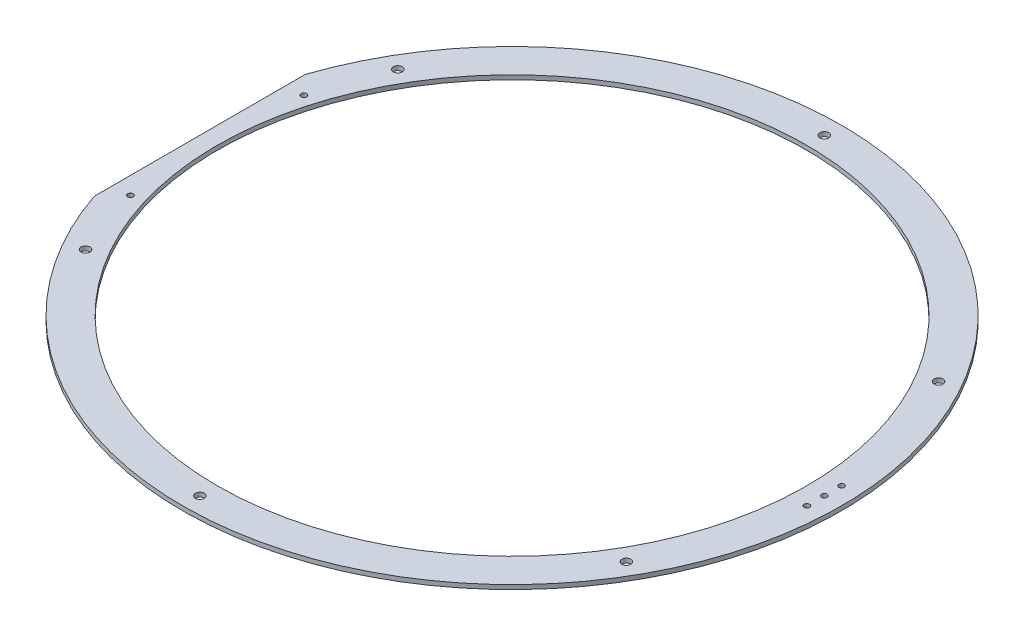
ISO-10303-21;
HEADER;
FILE_DESCRIPTION(('STEP AP214'),'2;1');
FILE_NAME('part.step','',(''),(''),'','','');
FILE_SCHEMA(('AUTOMOTIVE_DESIGN { 1 0 10303 214 1 1 1 1 }'));
ENDSEC;
DATA;
#1=APPLICATION_CONTEXT('core data for automotive mechanical design processes');
#2=APPLICATION_PROTOCOL_DEFINITION('international standard','automotive_design',2000,#1);
#3=PRODUCT_CONTEXT('',#1,'mechanical');
#4=PRODUCT('Part','Part','',(#3));
#5=PRODUCT_RELATED_PRODUCT_CATEGORY('part','',(#4));
#6=PRODUCT_DEFINITION_FORMATION('','',#4);
#7=PRODUCT_DEFINITION_CONTEXT('part definition',#1,'design');
#8=PRODUCT_DEFINITION('design','',#6,#7);
#9=PRODUCT_DEFINITION_SHAPE('','',#8);
#10=(LENGTH_UNIT() NAMED_UNIT(*) SI_UNIT(.MILLI.,.METRE.));
#11=(NAMED_UNIT(*) PLANE_ANGLE_UNIT() SI_UNIT($,.RADIAN.));
#12=(NAMED_UNIT(*) SI_UNIT($,.STERADIAN.) SOLID_ANGLE_UNIT());
#13=UNCERTAINTY_MEASURE_WITH_UNIT(LENGTH_MEASURE(1.E-05),#10,'distance_accuracy_value','');
#14=(GEOMETRIC_REPRESENTATION_CONTEXT(3) GLOBAL_UNCERTAINTY_ASSIGNED_CONTEXT((#13)) GLOBAL_UNIT_ASSIGNED_CONTEXT((#10,
#11,#12)) REPRESENTATION_CONTEXT('',''));
#15=CARTESIAN_POINT('',(0.,0.,0.));
#16=DIRECTION('',(0.,0.,1.));
#17=DIRECTION('',(1.,0.,0.));
#18=AXIS2_PLACEMENT_3D('',#15,#16,#17);
#19=CARTESIAN_POINT('',(-228.6,3.175,0.));
#20=DIRECTION('',(1.,0.,0.));
#21=DIRECTION('',(0.,0.,-1.));
#22=AXIS2_PLACEMENT_3D('',#19,#20,#21);
#23=PLANE('',#22);
#24=DIRECTION('',(0.,0.,1.));
#25=VECTOR('',#24,1.);
#26=CARTESIAN_POINT('',(-228.6,0.,0.));
#27=LINE('',#26,#25);
#28=CARTESIAN_POINT('',(-228.6,0.,-77.251084131));
#29=VERTEX_POINT('',#28);
#30=CARTESIAN_POINT('',(-228.6,0.,77.251084131));
#31=VERTEX_POINT('',#30);
#32=EDGE_CURVE('E71',#29,#31,#27,.T.);
#33=ORIENTED_EDGE('',*,*,#32,.T.);
#34=DIRECTION('',(0.,-1.,0.));
#35=VECTOR('',#34,1.);
#36=CARTESIAN_POINT('',(-228.6,3.175,77.251084131));
#37=LINE('',#36,#35);
#38=CARTESIAN_POINT('',(-228.6,3.175,77.251084131));
#39=VERTEX_POINT('',#38);
#40=EDGE_CURVE('E11',#39,#31,#37,.T.);
#41=ORIENTED_EDGE('',*,*,#40,.F.);
#42=DIRECTION('',(0.,0.,1.));
#43=VECTOR('',#42,1.);
#44=CARTESIAN_POINT('',(-228.6,3.175,0.));
#45=LINE('',#44,#43);
#46=CARTESIAN_POINT('',(-228.6,3.175,-77.251084131));
#47=VERTEX_POINT('',#46);
#48=EDGE_CURVE('E74',#47,#39,#45,.T.);
#49=ORIENTED_EDGE('',*,*,#48,.F.);
#50=DIRECTION('',(0.,-1.,0.));
#51=VECTOR('',#50,1.);
#52=CARTESIAN_POINT('',(-228.6,3.175,-77.251084131));
#53=LINE('',#52,#51);
#54=EDGE_CURVE('E48',#47,#29,#53,.T.);
#55=ORIENTED_EDGE('',*,*,#54,.T.);
#56=EDGE_LOOP('',(#33,#41,#49,#55));
#57=FACE_BOUND('',#56,.T.);
#58=ADVANCED_FACE('F39',(#57),#23,.F.);
#59=CARTESIAN_POINT('',(0.,3.175,0.));
#60=DIRECTION('',(0.,-1.,0.));
#61=DIRECTION('',(0.,0.,-1.));
#62=AXIS2_PLACEMENT_3D('',#59,#60,#61);
#63=CYLINDRICAL_SURFACE('',#62,215.9);
#64=CARTESIAN_POINT('',(0.,3.175,0.));
#65=DIRECTION('',(0.,1.,0.));
#66=DIRECTION('',(0.,0.,1.));
#67=AXIS2_PLACEMENT_3D('',#64,#65,#66);
#68=CIRCLE('',#67,215.9);
#69=CARTESIAN_POINT('',(0.,3.175,215.9));
#70=VERTEX_POINT('',#69);
#71=EDGE_CURVE('E116',#70,#70,#68,.T.);
#72=ORIENTED_EDGE('',*,*,#71,.T.);
#73=EDGE_LOOP('',(#72));
#74=FACE_BOUND('',#73,.T.);
#75=CARTESIAN_POINT('',(0.,0.,0.));
#76=DIRECTION('',(0.,1.,0.));
#77=DIRECTION('',(0.,0.,1.));
#78=AXIS2_PLACEMENT_3D('',#75,#76,#77);
#79=CIRCLE('',#78,215.9);
#80=CARTESIAN_POINT('',(0.,0.,215.9));
#81=VERTEX_POINT('',#80);
#82=EDGE_CURVE('E76',#81,#81,#79,.T.);
#83=ORIENTED_EDGE('',*,*,#82,.F.);
#84=EDGE_LOOP('',(#83));
#85=FACE_BOUND('',#84,.T.);
#86=ADVANCED_FACE('F180',(#74,#85),#63,.F.);
#87=CARTESIAN_POINT('',(0.,3.175,-228.6));
#88=DIRECTION('',(0.,-1.,0.));
#89=DIRECTION('',(0.,0.,-1.));
#90=AXIS2_PLACEMENT_3D('',#87,#88,#89);
#91=CYLINDRICAL_SURFACE('',#90,3.2639);
#92=CARTESIAN_POINT('',(0.,3.175,-228.6));
#93=DIRECTION('',(0.,1.,0.));
#94=DIRECTION('',(0.,0.,1.));
#95=AXIS2_PLACEMENT_3D('',#92,#93,#94);
#96=CIRCLE('',#95,3.2639);
#97=CARTESIAN_POINT('',(0.,3.175,-225.3361));
#98=VERTEX_POINT('',#97);
#99=EDGE_CURVE('E119',#98,#98,#96,.T.);
#100=ORIENTED_EDGE('',*,*,#99,.T.);
#101=EDGE_LOOP('',(#100));
#102=FACE_BOUND('',#101,.T.);
#103=CARTESIAN_POINT('',(0.,0.,-228.6));
#104=DIRECTION('',(0.,1.,0.));
#105=DIRECTION('',(0.,0.,1.));
#106=AXIS2_PLACEMENT_3D('',#103,#104,#105);
#107=CIRCLE('',#106,3.2639);
#108=CARTESIAN_POINT('',(0.,0.,-225.3361));
#109=VERTEX_POINT('',#108);
#110=EDGE_CURVE('E79',#109,#109,#107,.T.);
#111=ORIENTED_EDGE('',*,*,#110,.F.);
#112=EDGE_LOOP('',(#111));
#113=FACE_BOUND('',#112,.T.);
#114=ADVANCED_FACE('F183',(#102,#113),#91,.F.);
#115=CARTESIAN_POINT('',(197.973407305129,3.175,-114.300000000011));
#116=DIRECTION('',(0.,-1.,0.));
#117=DIRECTION('',(0.,0.,-1.));
#118=AXIS2_PLACEMENT_3D('',#115,#116,#117);
#119=CYLINDRICAL_SURFACE('',#118,3.26389999999998);
#120=CARTESIAN_POINT('',(197.973407305129,3.175,-114.300000000011));
#121=DIRECTION('',(0.,1.,0.));
#122=DIRECTION('',(0.,0.,1.));
#123=AXIS2_PLACEMENT_3D('',#120,#121,#122);
#124=CIRCLE('',#123,3.26389999999998);
#125=CARTESIAN_POINT('',(197.973407305129,3.175,-111.036100000011));
#126=VERTEX_POINT('',#125);
#127=EDGE_CURVE('E122',#126,#126,#124,.T.);
#128=ORIENTED_EDGE('',*,*,#127,.T.);
#129=EDGE_LOOP('',(#128));
#130=FACE_BOUND('',#129,.T.);
#131=CARTESIAN_POINT('',(197.973407305129,0.,-114.300000000011));
#132=DIRECTION('',(0.,1.,0.));
#133=DIRECTION('',(0.,0.,1.));
#134=AXIS2_PLACEMENT_3D('',#131,#132,#133);
#135=CIRCLE('',#134,3.26389999999998);
#136=CARTESIAN_POINT('',(197.973407305129,0.,-111.036100000011));
#137=VERTEX_POINT('',#136);
#138=EDGE_CURVE('E84',#137,#137,#135,.T.);
#139=ORIENTED_EDGE('',*,*,#138,.F.);
#140=EDGE_LOOP('',(#139));
#141=FACE_BOUND('',#140,.T.);
#142=ADVANCED_FACE('F201',(#130,#141),#119,.F.);
#143=CARTESIAN_POINT('',(197.973407305142,3.175,114.299999999989));
#144=DIRECTION('',(0.,-1.,0.));
#145=DIRECTION('',(0.,0.,-1.));
#146=AXIS2_PLACEMENT_3D('',#143,#144,#145);
#147=CYLINDRICAL_SURFACE('',#146,3.26389999999998);
#148=CARTESIAN_POINT('',(197.973407305142,3.175,114.299999999989));
#149=DIRECTION('',(0.,1.,0.));
#150=DIRECTION('',(0.,0.,1.));
#151=AXIS2_PLACEMENT_3D('',#148,#149,#150);
#152=CIRCLE('',#151,3.26389999999998);
#153=CARTESIAN_POINT('',(197.973407305142,3.175,117.563899999989));
#154=VERTEX_POINT('',#153);
#155=EDGE_CURVE('E125',#154,#154,#152,.T.);
#156=ORIENTED_EDGE('',*,*,#155,.T.);
#157=EDGE_LOOP('',(#156));
#158=FACE_BOUND('',#157,.T.);
#159=CARTESIAN_POINT('',(197.973407305142,0.,114.299999999989));
#160=DIRECTION('',(0.,1.,0.));
#161=DIRECTION('',(0.,0.,1.));
#162=AXIS2_PLACEMENT_3D('',#159,#160,#161);
#163=CIRCLE('',#162,3.26389999999998);
#164=CARTESIAN_POINT('',(197.973407305142,0.,117.563899999989));
#165=VERTEX_POINT('',#164);
#166=EDGE_CURVE('E87',#165,#165,#163,.T.);
#167=ORIENTED_EDGE('',*,*,#166,.F.);
#168=EDGE_LOOP('',(#167));
#169=FACE_BOUND('',#168,.T.);
#170=ADVANCED_FACE('F205',(#158,#169),#147,.F.);
#171=CARTESIAN_POINT('',(2.59048248256759E-11,3.175,228.6));
#172=DIRECTION('',(0.,-1.,0.));
#173=DIRECTION('',(0.,0.,-1.));
#174=AXIS2_PLACEMENT_3D('',#171,#172,#173);
#175=CYLINDRICAL_SURFACE('',#174,3.2639);
#176=CARTESIAN_POINT('',(2.59048248256759E-11,3.175,228.6));
#177=DIRECTION('',(0.,1.,0.));
#178=DIRECTION('',(0.,0.,1.));
#179=AXIS2_PLACEMENT_3D('',#176,#177,#178);
#180=CIRCLE('',#179,3.2639);
#181=CARTESIAN_POINT('',(2.59048248256759E-11,3.175,231.8639));
#182=VERTEX_POINT('',#181);
#183=EDGE_CURVE('E128',#182,#182,#180,.T.);
#184=ORIENTED_EDGE('',*,*,#183,.T.);
#185=EDGE_LOOP('',(#184));
#186=FACE_BOUND('',#185,.T.);
#187=CARTESIAN_POINT('',(2.59048248256759E-11,0.,228.6));
#188=DIRECTION('',(0.,1.,0.));
#189=DIRECTION('',(0.,0.,1.));
#190=AXIS2_PLACEMENT_3D('',#187,#188,#189);
#191=CIRCLE('',#190,3.2639);
#192=CARTESIAN_POINT('',(2.59048248256759E-11,0.,231.8639));
#193=VERTEX_POINT('',#192);
#194=EDGE_CURVE('E90',#193,#193,#191,.T.);
#195=ORIENTED_EDGE('',*,*,#194,.F.);
#196=EDGE_LOOP('',(#195));
#197=FACE_BOUND('',#196,.T.);
#198=ADVANCED_FACE('F209',(#186,#197),#175,.F.);
#199=CARTESIAN_POINT('',(-197.973407305103,3.175,114.300000000011));
#200=DIRECTION('',(0.,-1.,0.));
#201=DIRECTION('',(0.,0.,-1.));
#202=AXIS2_PLACEMENT_3D('',#199,#200,#201);
#203=CYLINDRICAL_SURFACE('',#202,3.26390000000001);
#204=CARTESIAN_POINT('',(-197.973407305103,3.175,114.300000000011));
#205=DIRECTION('',(0.,1.,0.));
#206=DIRECTION('',(0.,0.,1.));
#207=AXIS2_PLACEMENT_3D('',#204,#205,#206);
#208=CIRCLE('',#207,3.26390000000001);
#209=CARTESIAN_POINT('',(-197.973407305103,3.175,117.563900000011));
#210=VERTEX_POINT('',#209);
#211=EDGE_CURVE('E131',#210,#210,#208,.T.);
#212=ORIENTED_EDGE('',*,*,#211,.T.);
#213=EDGE_LOOP('',(#212));
#214=FACE_BOUND('',#213,.T.);
#215=CARTESIAN_POINT('',(-197.973407305103,0.,114.300000000011));
#216=DIRECTION('',(0.,1.,0.));
#217=DIRECTION('',(0.,0.,1.));
#218=AXIS2_PLACEMENT_3D('',#215,#216,#217);
#219=CIRCLE('',#218,3.26390000000001);
#220=CARTESIAN_POINT('',(-197.973407305103,0.,117.563900000011));
#221=VERTEX_POINT('',#220);
#222=EDGE_CURVE('E93',#221,#221,#219,.T.);
#223=ORIENTED_EDGE('',*,*,#222,.F.);
#224=EDGE_LOOP('',(#223));
#225=FACE_BOUND('',#224,.T.);
#226=ADVANCED_FACE('F213',(#214,#225),#203,.F.);
#227=CARTESIAN_POINT('',(-197.973407305116,3.175,-114.299999999989));
#228=DIRECTION('',(0.,-1.,0.));
#229=DIRECTION('',(0.,0.,-1.));
#230=AXIS2_PLACEMENT_3D('',#227,#228,#229);
#231=CYLINDRICAL_SURFACE('',#230,3.26390000000001);
#232=CARTESIAN_POINT('',(-197.973407305116,3.175,-114.299999999989));
#233=DIRECTION('',(0.,1.,0.));
#234=DIRECTION('',(0.,0.,1.));
#235=AXIS2_PLACEMENT_3D('',#232,#233,#234);
#236=CIRCLE('',#235,3.26390000000001);
#237=CARTESIAN_POINT('',(-197.973407305116,3.175,-111.036099999989));
#238=VERTEX_POINT('',#237);
#239=EDGE_CURVE('E134',#238,#238,#236,.T.);
#240=ORIENTED_EDGE('',*,*,#239,.T.);
#241=EDGE_LOOP('',(#240));
#242=FACE_BOUND('',#241,.T.);
#243=CARTESIAN_POINT('',(-197.973407305116,0.,-114.299999999989));
#244=DIRECTION('',(0.,1.,0.));
#245=DIRECTION('',(0.,0.,1.));
#246=AXIS2_PLACEMENT_3D('',#243,#244,#245);
#247=CIRCLE('',#246,3.26390000000001);
#248=CARTESIAN_POINT('',(-197.973407305116,0.,-111.036099999989));
#249=VERTEX_POINT('',#248);
#250=EDGE_CURVE('E96',#249,#249,#247,.T.);
#251=ORIENTED_EDGE('',*,*,#250,.F.);
#252=EDGE_LOOP('',(#251));
#253=FACE_BOUND('',#252,.T.);
#254=ADVANCED_FACE('F217',(#242,#253),#231,.F.);
#255=CARTESIAN_POINT('',(228.6,3.175,0.));
#256=DIRECTION('',(0.,-1.,0.));
#257=DIRECTION('',(0.,0.,-1.));
#258=AXIS2_PLACEMENT_3D('',#255,#256,#257);
#259=CYLINDRICAL_SURFACE('',#258,2.01930000000001);
#260=CARTESIAN_POINT('',(228.6,3.175,0.));
#261=DIRECTION('',(0.,1.,0.));
#262=DIRECTION('',(0.,0.,1.));
#263=AXIS2_PLACEMENT_3D('',#260,#261,#262);
#264=CIRCLE('',#263,2.01930000000001);
#265=CARTESIAN_POINT('',(228.6,3.175,2.01930000000001));
#266=VERTEX_POINT('',#265);
#267=EDGE_CURVE('E137',#266,#266,#264,.T.);
#268=ORIENTED_EDGE('',*,*,#267,.T.);
#269=EDGE_LOOP('',(#268));
#270=FACE_BOUND('',#269,.T.);
#271=CARTESIAN_POINT('',(228.6,0.,0.));
#272=DIRECTION('',(0.,1.,0.));
#273=DIRECTION('',(0.,0.,1.));
#274=AXIS2_PLACEMENT_3D('',#271,#272,#273);
#275=CIRCLE('',#274,2.01930000000001);
#276=CARTESIAN_POINT('',(228.6,0.,2.01930000000001));
#277=VERTEX_POINT('',#276);
#278=EDGE_CURVE('E99',#277,#277,#275,.T.);
#279=ORIENTED_EDGE('',*,*,#278,.F.);
#280=EDGE_LOOP('',(#279));
#281=FACE_BOUND('',#280,.T.);
#282=ADVANCED_FACE('F221',(#270,#281),#259,.F.);
#283=CARTESIAN_POINT('',(228.6,3.175,12.7));
#284=DIRECTION('',(0.,-1.,0.));
#285=DIRECTION('',(0.,0.,-1.));
#286=AXIS2_PLACEMENT_3D('',#283,#284,#285);
#287=CYLINDRICAL_SURFACE('',#286,2.01930000000001);
#288=CARTESIAN_POINT('',(228.6,3.175,12.7));
#289=DIRECTION('',(0.,1.,0.));
#290=DIRECTION('',(0.,0.,1.));
#291=AXIS2_PLACEMENT_3D('',#288,#289,#290);
#292=CIRCLE('',#291,2.01930000000001);
#293=CARTESIAN_POINT('',(228.6,3.175,14.7193));
#294=VERTEX_POINT('',#293);
#295=EDGE_CURVE('E140',#294,#294,#292,.T.);
#296=ORIENTED_EDGE('',*,*,#295,.T.);
#297=EDGE_LOOP('',(#296));
#298=FACE_BOUND('',#297,.T.);
#299=CARTESIAN_POINT('',(228.6,0.,12.7));
#300=DIRECTION('',(0.,1.,0.));
#301=DIRECTION('',(0.,0.,1.));
#302=AXIS2_PLACEMENT_3D('',#299,#300,#301);
#303=CIRCLE('',#302,2.01930000000001);
#304=CARTESIAN_POINT('',(228.6,0.,14.7193));
#305=VERTEX_POINT('',#304);
#306=EDGE_CURVE('E102',#305,#305,#303,.T.);
#307=ORIENTED_EDGE('',*,*,#306,.F.);
#308=EDGE_LOOP('',(#307));
#309=FACE_BOUND('',#308,.T.);
#310=ADVANCED_FACE('F225',(#298,#309),#287,.F.);
#311=CARTESIAN_POINT('',(228.6,3.175,-12.7));
#312=DIRECTION('',(0.,-1.,0.));
#313=DIRECTION('',(0.,0.,-1.));
#314=AXIS2_PLACEMENT_3D('',#311,#312,#313);
#315=CYLINDRICAL_SURFACE('',#314,2.01930000000001);
#316=CARTESIAN_POINT('',(228.6,3.175,-12.7));
#317=DIRECTION('',(0.,1.,0.));
#318=DIRECTION('',(0.,0.,1.));
#319=AXIS2_PLACEMENT_3D('',#316,#317,#318);
#320=CIRCLE('',#319,2.01930000000001);
#321=CARTESIAN_POINT('',(228.6,3.175,-10.6807));
#322=VERTEX_POINT('',#321);
#323=EDGE_CURVE('E143',#322,#322,#320,.T.);
#324=ORIENTED_EDGE('',*,*,#323,.T.);
#325=EDGE_LOOP('',(#324));
#326=FACE_BOUND('',#325,.T.);
#327=CARTESIAN_POINT('',(228.6,0.,-12.7));
#328=DIRECTION('',(0.,1.,0.));
#329=DIRECTION('',(0.,0.,1.));
#330=AXIS2_PLACEMENT_3D('',#327,#328,#329);
#331=CIRCLE('',#330,2.01930000000001);
#332=CARTESIAN_POINT('',(228.6,0.,-10.6807));
#333=VERTEX_POINT('',#332);
#334=EDGE_CURVE('E105',#333,#333,#331,.T.);
#335=ORIENTED_EDGE('',*,*,#334,.F.);
#336=EDGE_LOOP('',(#335));
#337=FACE_BOUND('',#336,.T.);
#338=ADVANCED_FACE('F229',(#326,#337),#315,.F.);
#339=CARTESIAN_POINT('',(-215.9,3.175,-63.4999999999999));
#340=DIRECTION('',(0.,-1.,0.));
#341=DIRECTION('',(0.,0.,-1.));
#342=AXIS2_PLACEMENT_3D('',#339,#340,#341);
#343=CYLINDRICAL_SURFACE('',#342,2.01930000000001);
#344=CARTESIAN_POINT('',(-215.9,3.175,-63.4999999999999));
#345=DIRECTION('',(0.,1.,0.));
#346=DIRECTION('',(0.,0.,1.));
#347=AXIS2_PLACEMENT_3D('',#344,#345,#346);
#348=CIRCLE('',#347,2.01930000000001);
#349=CARTESIAN_POINT('',(-215.9,3.175,-61.4806999999999));
#350=VERTEX_POINT('',#349);
#351=EDGE_CURVE('E146',#350,#350,#348,.T.);
#352=ORIENTED_EDGE('',*,*,#351,.T.);
#353=EDGE_LOOP('',(#352));
#354=FACE_BOUND('',#353,.T.);
#355=CARTESIAN_POINT('',(-215.9,0.,-63.4999999999999));
#356=DIRECTION('',(0.,1.,0.));
#357=DIRECTION('',(0.,0.,1.));
#358=AXIS2_PLACEMENT_3D('',#355,#356,#357);
#359=CIRCLE('',#358,2.01930000000001);
#360=CARTESIAN_POINT('',(-215.9,0.,-61.4806999999999));
#361=VERTEX_POINT('',#360);
#362=EDGE_CURVE('E108',#361,#361,#359,.T.);
#363=ORIENTED_EDGE('',*,*,#362,.F.);
#364=EDGE_LOOP('',(#363));
#365=FACE_BOUND('',#364,.T.);
#366=ADVANCED_FACE('F232',(#354,#365),#343,.F.);
#367=CARTESIAN_POINT('',(-215.9,3.175,63.5000000000001));
#368=DIRECTION('',(0.,-1.,0.));
#369=DIRECTION('',(0.,0.,-1.));
#370=AXIS2_PLACEMENT_3D('',#367,#368,#369);
#371=CYLINDRICAL_SURFACE('',#370,2.01930000000001);
#372=CARTESIAN_POINT('',(-215.9,3.175,63.5000000000001));
#373=DIRECTION('',(0.,1.,0.));
#374=DIRECTION('',(0.,0.,1.));
#375=AXIS2_PLACEMENT_3D('',#372,#373,#374);
#376=CIRCLE('',#375,2.01930000000001);
#377=CARTESIAN_POINT('',(-215.9,3.175,65.5193000000001));
#378=VERTEX_POINT('',#377);
#379=EDGE_CURVE('E70',#378,#378,#376,.T.);
#380=ORIENTED_EDGE('',*,*,#379,.T.);
#381=EDGE_LOOP('',(#380));
#382=FACE_BOUND('',#381,.T.);
#383=CARTESIAN_POINT('',(-215.9,0.,63.5000000000001));
#384=DIRECTION('',(0.,1.,0.));
#385=DIRECTION('',(0.,0.,1.));
#386=AXIS2_PLACEMENT_3D('',#383,#384,#385);
#387=CIRCLE('',#386,2.01930000000001);
#388=CARTESIAN_POINT('',(-215.9,0.,65.5193000000001));
#389=VERTEX_POINT('',#388);
#390=EDGE_CURVE('E111',#389,#389,#387,.T.);
#391=ORIENTED_EDGE('',*,*,#390,.F.);
#392=EDGE_LOOP('',(#391));
#393=FACE_BOUND('',#392,.T.);
#394=ADVANCED_FACE('F41',(#382,#393),#371,.F.);
#395=CARTESIAN_POINT('',(0.,3.175,0.));
#396=DIRECTION('',(0.,-1.,0.));
#397=DIRECTION('',(0.,0.,-1.));
#398=AXIS2_PLACEMENT_3D('',#395,#396,#397);
#399=CYLINDRICAL_SURFACE('',#398,241.3);
#400=CARTESIAN_POINT('',(0.,0.,0.));
#401=DIRECTION('',(0.,1.,0.));
#402=DIRECTION('',(0.,0.,1.));
#403=AXIS2_PLACEMENT_3D('',#400,#401,#402);
#404=CIRCLE('',#403,241.3);
#405=EDGE_CURVE('E63',#31,#29,#404,.T.);
#406=ORIENTED_EDGE('',*,*,#405,.T.);
#407=ORIENTED_EDGE('',*,*,#54,.F.);
#408=CARTESIAN_POINT('',(0.,3.175,0.));
#409=DIRECTION('',(0.,1.,0.));
#410=DIRECTION('',(0.,0.,1.));
#411=AXIS2_PLACEMENT_3D('',#408,#409,#410);
#412=CIRCLE('',#411,241.3);
#413=EDGE_CURVE('E55',#39,#47,#412,.T.);
#414=ORIENTED_EDGE('',*,*,#413,.F.);
#415=ORIENTED_EDGE('',*,*,#40,.T.);
#416=EDGE_LOOP('',(#406,#407,#414,#415));
#417=FACE_BOUND('',#416,.T.);
#418=ADVANCED_FACE('F66',(#417),#399,.T.);
#419=CARTESIAN_POINT('',(0.,3.175,0.));
#420=DIRECTION('',(0.,1.,0.));
#421=DIRECTION('',(0.,0.,1.));
#422=AXIS2_PLACEMENT_3D('',#419,#420,#421);
#423=PLANE('',#422);
#424=ORIENTED_EDGE('',*,*,#379,.F.);
#425=EDGE_LOOP('',(#424));
#426=FACE_BOUND('',#425,.T.);
#427=ORIENTED_EDGE('',*,*,#351,.F.);
#428=EDGE_LOOP('',(#427));
#429=FACE_BOUND('',#428,.T.);
#430=ORIENTED_EDGE('',*,*,#323,.F.);
#431=EDGE_LOOP('',(#430));
#432=FACE_BOUND('',#431,.T.);
#433=ORIENTED_EDGE('',*,*,#295,.F.);
#434=EDGE_LOOP('',(#433));
#435=FACE_BOUND('',#434,.T.);
#436=ORIENTED_EDGE('',*,*,#267,.F.);
#437=EDGE_LOOP('',(#436));
#438=FACE_BOUND('',#437,.T.);
#439=ORIENTED_EDGE('',*,*,#239,.F.);
#440=EDGE_LOOP('',(#439));
#441=FACE_BOUND('',#440,.T.);
#442=ORIENTED_EDGE('',*,*,#211,.F.);
#443=EDGE_LOOP('',(#442));
#444=FACE_BOUND('',#443,.T.);
#445=ORIENTED_EDGE('',*,*,#183,.F.);
#446=EDGE_LOOP('',(#445));
#447=FACE_BOUND('',#446,.T.);
#448=ORIENTED_EDGE('',*,*,#155,.F.);
#449=EDGE_LOOP('',(#448));
#450=FACE_BOUND('',#449,.T.);
#451=ORIENTED_EDGE('',*,*,#127,.F.);
#452=EDGE_LOOP('',(#451));
#453=FACE_BOUND('',#452,.T.);
#454=ORIENTED_EDGE('',*,*,#99,.F.);
#455=EDGE_LOOP('',(#454));
#456=FACE_BOUND('',#455,.T.);
#457=ORIENTED_EDGE('',*,*,#71,.F.);
#458=EDGE_LOOP('',(#457));
#459=FACE_BOUND('',#458,.T.);
#460=ORIENTED_EDGE('',*,*,#48,.T.);
#461=ORIENTED_EDGE('',*,*,#413,.T.);
#462=EDGE_LOOP('',(#460,#461));
#463=FACE_BOUND('',#462,.T.);
#464=ADVANCED_FACE('F154',(#426,#429,#432,#435,#438,#441,#444,#447,#450,#453,#456,#459,#463),
#423,.T.);
#465=CARTESIAN_POINT('',(0.,0.,0.));
#466=DIRECTION('',(0.,1.,0.));
#467=DIRECTION('',(0.,0.,1.));
#468=AXIS2_PLACEMENT_3D('',#465,#466,#467);
#469=PLANE('',#468);
#470=ORIENTED_EDGE('',*,*,#390,.T.);
#471=EDGE_LOOP('',(#470));
#472=FACE_BOUND('',#471,.T.);
#473=ORIENTED_EDGE('',*,*,#362,.T.);
#474=EDGE_LOOP('',(#473));
#475=FACE_BOUND('',#474,.T.);
#476=ORIENTED_EDGE('',*,*,#334,.T.);
#477=EDGE_LOOP('',(#476));
#478=FACE_BOUND('',#477,.T.);
#479=ORIENTED_EDGE('',*,*,#306,.T.);
#480=EDGE_LOOP('',(#479));
#481=FACE_BOUND('',#480,.T.);
#482=ORIENTED_EDGE('',*,*,#278,.T.);
#483=EDGE_LOOP('',(#482));
#484=FACE_BOUND('',#483,.T.);
#485=ORIENTED_EDGE('',*,*,#250,.T.);
#486=EDGE_LOOP('',(#485));
#487=FACE_BOUND('',#486,.T.);
#488=ORIENTED_EDGE('',*,*,#222,.T.);
#489=EDGE_LOOP('',(#488));
#490=FACE_BOUND('',#489,.T.);
#491=ORIENTED_EDGE('',*,*,#194,.T.);
#492=EDGE_LOOP('',(#491));
#493=FACE_BOUND('',#492,.T.);
#494=ORIENTED_EDGE('',*,*,#166,.T.);
#495=EDGE_LOOP('',(#494));
#496=FACE_BOUND('',#495,.T.);
#497=ORIENTED_EDGE('',*,*,#138,.T.);
#498=EDGE_LOOP('',(#497));
#499=FACE_BOUND('',#498,.T.);
#500=ORIENTED_EDGE('',*,*,#110,.T.);
#501=EDGE_LOOP('',(#500));
#502=FACE_BOUND('',#501,.T.);
#503=ORIENTED_EDGE('',*,*,#82,.T.);
#504=EDGE_LOOP('',(#503));
#505=FACE_BOUND('',#504,.T.);
#506=ORIENTED_EDGE('',*,*,#32,.F.);
#507=ORIENTED_EDGE('',*,*,#405,.F.);
#508=EDGE_LOOP('',(#506,#507));
#509=FACE_BOUND('',#508,.T.);
#510=ADVANCED_FACE('F75',(#472,#475,#478,#481,#484,#487,#490,#493,#496,#499,#502,#505,#509),
#469,.F.);
#511=CLOSED_SHELL('',(#58,#86,#114,#142,#170,#198,#226,#254,#282,#310,#338,#366,#394,#418,#464,#510));
#512=MANIFOLD_SOLID_BREP('B2',#511);
#513=ADVANCED_BREP_SHAPE_REPRESENTATION('',(#18,#512),#14);
#514=SHAPE_DEFINITION_REPRESENTATION(#9,#513);
ENDSEC;
END-ISO-10303-21;
